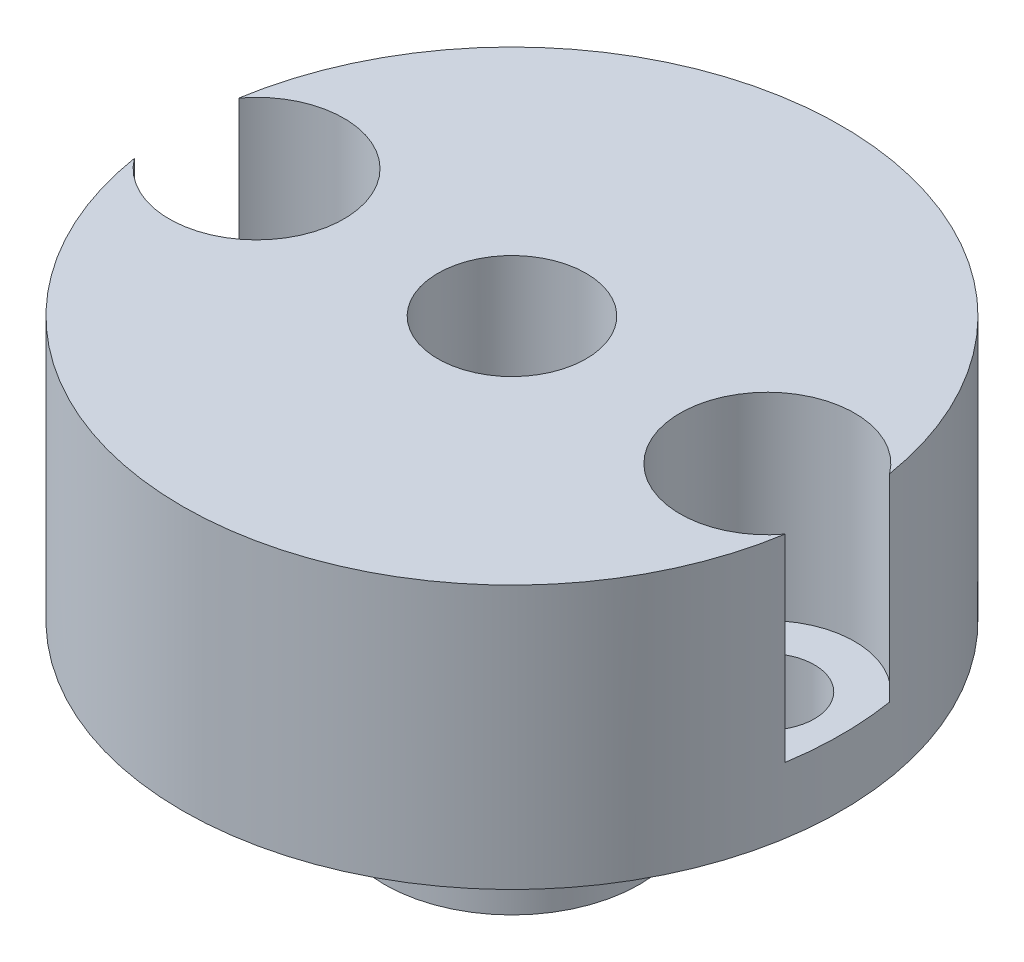
ISO-10303-21;
HEADER;
FILE_DESCRIPTION(('STEP AP214'),'2;1');
FILE_NAME('part.step','',(''),(''),'','','');
FILE_SCHEMA(('AUTOMOTIVE_DESIGN { 1 0 10303 214 1 1 1 1 }'));
ENDSEC;
DATA;
#1=APPLICATION_CONTEXT('core data for automotive mechanical design processes');
#2=APPLICATION_PROTOCOL_DEFINITION('international standard','automotive_design',2000,#1);
#3=PRODUCT_CONTEXT('',#1,'mechanical');
#4=PRODUCT('Part','Part','',(#3));
#5=PRODUCT_RELATED_PRODUCT_CATEGORY('part','',(#4));
#6=PRODUCT_DEFINITION_FORMATION('','',#4);
#7=PRODUCT_DEFINITION_CONTEXT('part definition',#1,'design');
#8=PRODUCT_DEFINITION('design','',#6,#7);
#9=PRODUCT_DEFINITION_SHAPE('','',#8);
#10=(LENGTH_UNIT() NAMED_UNIT(*) SI_UNIT(.MILLI.,.METRE.));
#11=(NAMED_UNIT(*) PLANE_ANGLE_UNIT() SI_UNIT($,.RADIAN.));
#12=(NAMED_UNIT(*) SI_UNIT($,.STERADIAN.) SOLID_ANGLE_UNIT());
#13=UNCERTAINTY_MEASURE_WITH_UNIT(LENGTH_MEASURE(1.E-05),#10,'distance_accuracy_value','');
#14=(GEOMETRIC_REPRESENTATION_CONTEXT(3) GLOBAL_UNCERTAINTY_ASSIGNED_CONTEXT((#13)) GLOBAL_UNIT_ASSIGNED_CONTEXT((#10,
#11,#12)) REPRESENTATION_CONTEXT('',''));
#15=CARTESIAN_POINT('',(0.,0.,0.));
#16=DIRECTION('',(0.,0.,1.));
#17=DIRECTION('',(1.,0.,0.));
#18=AXIS2_PLACEMENT_3D('',#15,#16,#17);
#19=CARTESIAN_POINT('',(7.75,-4.03050865276332,0.));
#20=DIRECTION('',(0.,1.,0.));
#21=DIRECTION('',(0.,0.,1.));
#22=AXIS2_PLACEMENT_3D('',#19,#20,#21);
#23=CYLINDRICAL_SURFACE('',#22,1.425);
#24=CARTESIAN_POINT('',(7.75,0.999999999999999,0.));
#25=DIRECTION('',(0.,1.,0.));
#26=DIRECTION('',(0.,0.,1.));
#27=AXIS2_PLACEMENT_3D('',#24,#25,#26);
#28=CIRCLE('',#27,1.425);
#29=CARTESIAN_POINT('',(7.75,0.999999999999999,1.425));
#30=VERTEX_POINT('',#29);
#31=EDGE_CURVE('E124',#30,#30,#28,.T.);
#32=ORIENTED_EDGE('',*,*,#31,.F.);
#33=EDGE_LOOP('',(#32));
#34=FACE_BOUND('',#33,.T.);
#35=CARTESIAN_POINT('',(7.75,3.,0.));
#36=DIRECTION('',(0.,1.,0.));
#37=DIRECTION('',(0.,0.,1.));
#38=AXIS2_PLACEMENT_3D('',#35,#36,#37);
#39=CIRCLE('',#38,1.425);
#40=CARTESIAN_POINT('',(7.75,3.,1.425));
#41=VERTEX_POINT('',#40);
#42=EDGE_CURVE('E37',#41,#41,#39,.F.);
#43=ORIENTED_EDGE('',*,*,#42,.F.);
#44=EDGE_LOOP('',(#43));
#45=FACE_BOUND('',#44,.T.);
#46=ADVANCED_FACE('F33',(#34,#45),#23,.F.);
#47=CARTESIAN_POINT('',(-7.75,-4.03050865276332,0.));
#48=DIRECTION('',(0.,1.,0.));
#49=DIRECTION('',(0.,0.,1.));
#50=AXIS2_PLACEMENT_3D('',#47,#48,#49);
#51=CYLINDRICAL_SURFACE('',#50,1.425);
#52=CARTESIAN_POINT('',(-7.75,0.999999999999999,0.));
#53=DIRECTION('',(0.,1.,0.));
#54=DIRECTION('',(0.,0.,1.));
#55=AXIS2_PLACEMENT_3D('',#52,#53,#54);
#56=CIRCLE('',#55,1.425);
#57=CARTESIAN_POINT('',(-7.75,0.999999999999999,1.425));
#58=VERTEX_POINT('',#57);
#59=EDGE_CURVE('E103',#58,#58,#56,.T.);
#60=ORIENTED_EDGE('',*,*,#59,.F.);
#61=EDGE_LOOP('',(#60));
#62=FACE_BOUND('',#61,.T.);
#63=CARTESIAN_POINT('',(-7.75,3.,0.));
#64=DIRECTION('',(0.,1.,0.));
#65=DIRECTION('',(0.,0.,1.));
#66=AXIS2_PLACEMENT_3D('',#63,#64,#65);
#67=CIRCLE('',#66,1.425);
#68=CARTESIAN_POINT('',(-7.75,3.,1.425));
#69=VERTEX_POINT('',#68);
#70=EDGE_CURVE('E112',#69,#69,#67,.F.);
#71=ORIENTED_EDGE('',*,*,#70,.F.);
#72=EDGE_LOOP('',(#71));
#73=FACE_BOUND('',#72,.T.);
#74=ADVANCED_FACE('F136',(#62,#73),#51,.F.);
#75=CARTESIAN_POINT('',(0.,24.2735064736294,0.));
#76=DIRECTION('',(0.,-1.,0.));
#77=DIRECTION('',(0.,0.,-1.));
#78=AXIS2_PLACEMENT_3D('',#75,#76,#77);
#79=CYLINDRICAL_SURFACE('',#78,5.4);
#80=CARTESIAN_POINT('',(0.,0.,0.));
#81=DIRECTION('',(0.,1.,0.));
#82=DIRECTION('',(0.,0.,1.));
#83=AXIS2_PLACEMENT_3D('',#80,#81,#82);
#84=CIRCLE('',#83,5.4);
#85=CARTESIAN_POINT('',(0.,0.,5.4));
#86=VERTEX_POINT('',#85);
#87=EDGE_CURVE('E101',#86,#86,#84,.T.);
#88=ORIENTED_EDGE('',*,*,#87,.T.);
#89=EDGE_LOOP('',(#88));
#90=FACE_BOUND('',#89,.T.);
#91=CARTESIAN_POINT('',(0.,0.999999999999997,0.));
#92=DIRECTION('',(0.,1.,0.));
#93=DIRECTION('',(0.,0.,1.));
#94=AXIS2_PLACEMENT_3D('',#91,#92,#93);
#95=CIRCLE('',#94,5.4);
#96=CARTESIAN_POINT('',(0.,0.999999999999997,5.4));
#97=VERTEX_POINT('',#96);
#98=EDGE_CURVE('E11',#97,#97,#95,.T.);
#99=ORIENTED_EDGE('',*,*,#98,.F.);
#100=EDGE_LOOP('',(#99));
#101=FACE_BOUND('',#100,.T.);
#102=ADVANCED_FACE('F139',(#90,#101),#79,.T.);
#103=CARTESIAN_POINT('',(0.,-4.,0.));
#104=DIRECTION('',(0.,1.,0.));
#105=DIRECTION('',(0.,0.,1.));
#106=AXIS2_PLACEMENT_3D('',#103,#104,#105);
#107=CYLINDRICAL_SURFACE('',#106,3.875);
#108=CARTESIAN_POINT('',(0.,-4.,0.));
#109=DIRECTION('',(0.,1.,0.));
#110=DIRECTION('',(0.,0.,1.));
#111=AXIS2_PLACEMENT_3D('',#108,#109,#110);
#112=CIRCLE('',#111,3.875);
#113=CARTESIAN_POINT('',(0.,-4.,3.875));
#114=VERTEX_POINT('',#113);
#115=EDGE_CURVE('E42',#114,#114,#112,.T.);
#116=ORIENTED_EDGE('',*,*,#115,.T.);
#117=EDGE_LOOP('',(#116));
#118=FACE_BOUND('',#117,.T.);
#119=CARTESIAN_POINT('',(0.,0.,0.));
#120=DIRECTION('',(0.,1.,0.));
#121=DIRECTION('',(0.,0.,1.));
#122=AXIS2_PLACEMENT_3D('',#119,#120,#121);
#123=CIRCLE('',#122,3.875);
#124=CARTESIAN_POINT('',(0.,0.,3.875));
#125=VERTEX_POINT('',#124);
#126=EDGE_CURVE('E108',#125,#125,#123,.F.);
#127=ORIENTED_EDGE('',*,*,#126,.T.);
#128=EDGE_LOOP('',(#127));
#129=FACE_BOUND('',#128,.T.);
#130=ADVANCED_FACE('F35',(#118,#129),#107,.T.);
#131=CARTESIAN_POINT('',(0.,-4.,0.));
#132=DIRECTION('',(0.,1.,0.));
#133=DIRECTION('',(0.,0.,1.));
#134=AXIS2_PLACEMENT_3D('',#131,#132,#133);
#135=PLANE('',#134);
#136=CARTESIAN_POINT('',(0.,-4.,0.));
#137=DIRECTION('',(0.,1.,0.));
#138=DIRECTION('',(0.,0.,1.));
#139=AXIS2_PLACEMENT_3D('',#136,#137,#138);
#140=CIRCLE('',#139,2.25);
#141=CARTESIAN_POINT('',(0.,-4.,2.25));
#142=VERTEX_POINT('',#141);
#143=EDGE_CURVE('E85',#142,#142,#140,.T.);
#144=ORIENTED_EDGE('',*,*,#143,.T.);
#145=EDGE_LOOP('',(#144));
#146=FACE_BOUND('',#145,.T.);
#147=ORIENTED_EDGE('',*,*,#115,.F.);
#148=EDGE_LOOP('',(#147));
#149=FACE_BOUND('',#148,.T.);
#150=ADVANCED_FACE('F160',(#146,#149),#135,.F.);
#151=CARTESIAN_POINT('',(0.,0.,0.));
#152=DIRECTION('',(0.,1.,0.));
#153=DIRECTION('',(0.,0.,1.));
#154=AXIS2_PLACEMENT_3D('',#151,#152,#153);
#155=PLANE('',#154);
#156=ORIENTED_EDGE('',*,*,#126,.F.);
#157=EDGE_LOOP('',(#156));
#158=FACE_BOUND('',#157,.T.);
#159=ORIENTED_EDGE('',*,*,#87,.F.);
#160=EDGE_LOOP('',(#159));
#161=FACE_BOUND('',#160,.T.);
#162=ADVANCED_FACE('F158',(#158,#161),#155,.F.);
#163=CARTESIAN_POINT('',(0.,0.999999999999999,0.));
#164=DIRECTION('',(0.,1.,0.));
#165=DIRECTION('',(0.,0.,1.));
#166=AXIS2_PLACEMENT_3D('',#163,#164,#165);
#167=CYLINDRICAL_SURFACE('',#166,10.);
#168=DIRECTION('',(0.,1.,0.));
#169=VECTOR('',#168,1.);
#170=CARTESIAN_POINT('',(9.87354838709677,6.,-1.58525778586913));
#171=LINE('',#170,#169);
#172=CARTESIAN_POINT('',(9.87354838709677,3.,-1.58525778586913));
#173=VERTEX_POINT('',#172);
#174=CARTESIAN_POINT('',(9.87354838709677,9.,-1.58525778586913));
#175=VERTEX_POINT('',#174);
#176=EDGE_CURVE('E50',#173,#175,#171,.T.);
#177=ORIENTED_EDGE('',*,*,#176,.F.);
#178=CARTESIAN_POINT('',(0.,3.,0.));
#179=DIRECTION('',(0.,1.,0.));
#180=DIRECTION('',(0.,0.,1.));
#181=AXIS2_PLACEMENT_3D('',#178,#179,#180);
#182=CIRCLE('',#181,10.);
#183=CARTESIAN_POINT('',(9.87354838709677,3.,1.58525778586913));
#184=VERTEX_POINT('',#183);
#185=EDGE_CURVE('E93',#173,#184,#182,.F.);
#186=ORIENTED_EDGE('',*,*,#185,.T.);
#187=DIRECTION('',(0.,1.,0.));
#188=VECTOR('',#187,1.);
#189=CARTESIAN_POINT('',(9.87354838709677,6.,1.58525778586913));
#190=LINE('',#189,#188);
#191=CARTESIAN_POINT('',(9.87354838709677,9.,1.58525778586913));
#192=VERTEX_POINT('',#191);
#193=EDGE_CURVE('E79',#192,#184,#190,.F.);
#194=ORIENTED_EDGE('',*,*,#193,.F.);
#195=CARTESIAN_POINT('',(0.,9.,0.));
#196=DIRECTION('',(0.,1.,0.));
#197=DIRECTION('',(0.,0.,1.));
#198=AXIS2_PLACEMENT_3D('',#195,#196,#197);
#199=CIRCLE('',#198,10.);
#200=CARTESIAN_POINT('',(-9.87354838709677,9.,1.58525778586913));
#201=VERTEX_POINT('',#200);
#202=EDGE_CURVE('E92',#201,#192,#199,.T.);
#203=ORIENTED_EDGE('',*,*,#202,.F.);
#204=DIRECTION('',(0.,1.,0.));
#205=VECTOR('',#204,1.);
#206=CARTESIAN_POINT('',(-9.87354838709677,6.,1.58525778586913));
#207=LINE('',#206,#205);
#208=CARTESIAN_POINT('',(-9.87354838709677,3.,1.58525778586913));
#209=VERTEX_POINT('',#208);
#210=EDGE_CURVE('E58',#209,#201,#207,.T.);
#211=ORIENTED_EDGE('',*,*,#210,.F.);
#212=CARTESIAN_POINT('',(0.,3.,0.));
#213=DIRECTION('',(0.,1.,0.));
#214=DIRECTION('',(0.,0.,1.));
#215=AXIS2_PLACEMENT_3D('',#212,#213,#214);
#216=CIRCLE('',#215,10.);
#217=CARTESIAN_POINT('',(-9.87354838709677,3.,-1.58525778586913));
#218=VERTEX_POINT('',#217);
#219=EDGE_CURVE('E114',#209,#218,#216,.F.);
#220=ORIENTED_EDGE('',*,*,#219,.T.);
#221=DIRECTION('',(0.,1.,0.));
#222=VECTOR('',#221,1.);
#223=CARTESIAN_POINT('',(-9.87354838709677,6.,-1.58525778586913));
#224=LINE('',#223,#222);
#225=CARTESIAN_POINT('',(-9.87354838709677,9.,-1.58525778586913));
#226=VERTEX_POINT('',#225);
#227=EDGE_CURVE('E119',#226,#218,#224,.F.);
#228=ORIENTED_EDGE('',*,*,#227,.F.);
#229=EDGE_CURVE('E98',#175,#226,#199,.T.);
#230=ORIENTED_EDGE('',*,*,#229,.F.);
#231=EDGE_LOOP('',(#177,#186,#194,#203,#211,#220,#228,#230));
#232=FACE_BOUND('',#231,.T.);
#233=CARTESIAN_POINT('',(0.,0.999999999999999,0.));
#234=DIRECTION('',(0.,1.,0.));
#235=DIRECTION('',(0.,0.,1.));
#236=AXIS2_PLACEMENT_3D('',#233,#234,#235);
#237=CIRCLE('',#236,10.);
#238=CARTESIAN_POINT('',(0.,0.999999999999999,10.));
#239=VERTEX_POINT('',#238);
#240=EDGE_CURVE('E97',#239,#239,#237,.T.);
#241=ORIENTED_EDGE('',*,*,#240,.T.);
#242=EDGE_LOOP('',(#241));
#243=FACE_BOUND('',#242,.T.);
#244=ADVANCED_FACE('F90',(#232,#243),#167,.T.);
#245=CARTESIAN_POINT('',(0.,0.999999999999999,0.));
#246=DIRECTION('',(0.,1.,0.));
#247=DIRECTION('',(0.,0.,1.));
#248=AXIS2_PLACEMENT_3D('',#245,#246,#247);
#249=PLANE('',#248);
#250=ORIENTED_EDGE('',*,*,#31,.T.);
#251=EDGE_LOOP('',(#250));
#252=FACE_BOUND('',#251,.T.);
#253=ORIENTED_EDGE('',*,*,#59,.T.);
#254=EDGE_LOOP('',(#253));
#255=FACE_BOUND('',#254,.T.);
#256=ORIENTED_EDGE('',*,*,#98,.T.);
#257=EDGE_LOOP('',(#256));
#258=FACE_BOUND('',#257,.T.);
#259=ORIENTED_EDGE('',*,*,#240,.F.);
#260=EDGE_LOOP('',(#259));
#261=FACE_BOUND('',#260,.T.);
#262=ADVANCED_FACE('F133',(#252,#255,#258,#261),#249,.F.);
#263=CARTESIAN_POINT('',(0.,9.,0.));
#264=DIRECTION('',(0.,1.,0.));
#265=DIRECTION('',(0.,0.,1.));
#266=AXIS2_PLACEMENT_3D('',#263,#264,#265);
#267=PLANE('',#266);
#268=CARTESIAN_POINT('',(0.,9.,0.));
#269=DIRECTION('',(0.,-1.,0.));
#270=DIRECTION('',(0.,0.,-1.));
#271=AXIS2_PLACEMENT_3D('',#268,#269,#270);
#272=CIRCLE('',#271,2.25);
#273=CARTESIAN_POINT('',(0.,9.,-2.25));
#274=VERTEX_POINT('',#273);
#275=EDGE_CURVE('E185',#274,#274,#272,.T.);
#276=ORIENTED_EDGE('',*,*,#275,.T.);
#277=EDGE_LOOP('',(#276));
#278=FACE_BOUND('',#277,.T.);
#279=CARTESIAN_POINT('',(7.75,9.,0.));
#280=DIRECTION('',(0.,1.,0.));
#281=DIRECTION('',(0.,0.,-1.));
#282=AXIS2_PLACEMENT_3D('',#279,#280,#281);
#283=CIRCLE('',#282,2.65);
#284=EDGE_CURVE('E76',#175,#192,#283,.T.);
#285=ORIENTED_EDGE('',*,*,#284,.F.);
#286=ORIENTED_EDGE('',*,*,#229,.T.);
#287=CARTESIAN_POINT('',(-7.75,9.,0.));
#288=DIRECTION('',(0.,1.,0.));
#289=DIRECTION('',(0.,0.,1.));
#290=AXIS2_PLACEMENT_3D('',#287,#288,#289);
#291=CIRCLE('',#290,2.65);
#292=EDGE_CURVE('E96',#201,#226,#291,.T.);
#293=ORIENTED_EDGE('',*,*,#292,.F.);
#294=ORIENTED_EDGE('',*,*,#202,.T.);
#295=EDGE_LOOP('',(#285,#286,#293,#294));
#296=FACE_BOUND('',#295,.T.);
#297=ADVANCED_FACE('F95',(#278,#296),#267,.T.);
#298=CARTESIAN_POINT('',(-7.75,3.,0.));
#299=DIRECTION('',(0.,1.,0.));
#300=DIRECTION('',(0.,0.,1.));
#301=AXIS2_PLACEMENT_3D('',#298,#299,#300);
#302=PLANE('',#301);
#303=CARTESIAN_POINT('',(-7.75,3.,0.));
#304=DIRECTION('',(0.,1.,0.));
#305=DIRECTION('',(0.,0.,1.));
#306=AXIS2_PLACEMENT_3D('',#303,#304,#305);
#307=CIRCLE('',#306,2.65);
#308=EDGE_CURVE('E115',#209,#218,#307,.T.);
#309=ORIENTED_EDGE('',*,*,#308,.T.);
#310=ORIENTED_EDGE('',*,*,#219,.F.);
#311=EDGE_LOOP('',(#309,#310));
#312=FACE_BOUND('',#311,.T.);
#313=ORIENTED_EDGE('',*,*,#70,.T.);
#314=EDGE_LOOP('',(#313));
#315=FACE_BOUND('',#314,.T.);
#316=ADVANCED_FACE('F164',(#312,#315),#302,.T.);
#317=CARTESIAN_POINT('',(-7.75,3.,0.));
#318=DIRECTION('',(0.,1.,0.));
#319=DIRECTION('',(0.,0.,1.));
#320=AXIS2_PLACEMENT_3D('',#317,#318,#319);
#321=CYLINDRICAL_SURFACE('',#320,2.65);
#322=ORIENTED_EDGE('',*,*,#210,.T.);
#323=ORIENTED_EDGE('',*,*,#292,.T.);
#324=ORIENTED_EDGE('',*,*,#227,.T.);
#325=ORIENTED_EDGE('',*,*,#308,.F.);
#326=EDGE_LOOP('',(#322,#323,#324,#325));
#327=FACE_BOUND('',#326,.T.);
#328=ADVANCED_FACE('F151',(#327),#321,.F.);
#329=CARTESIAN_POINT('',(7.75,3.,0.));
#330=DIRECTION('',(0.,1.,0.));
#331=DIRECTION('',(0.,0.,-1.));
#332=AXIS2_PLACEMENT_3D('',#329,#330,#331);
#333=PLANE('',#332);
#334=CARTESIAN_POINT('',(7.75,3.,0.));
#335=DIRECTION('',(0.,1.,0.));
#336=DIRECTION('',(0.,0.,-1.));
#337=AXIS2_PLACEMENT_3D('',#334,#335,#336);
#338=CIRCLE('',#337,2.65);
#339=EDGE_CURVE('E84',#173,#184,#338,.T.);
#340=ORIENTED_EDGE('',*,*,#339,.T.);
#341=ORIENTED_EDGE('',*,*,#185,.F.);
#342=EDGE_LOOP('',(#340,#341));
#343=FACE_BOUND('',#342,.T.);
#344=ORIENTED_EDGE('',*,*,#42,.T.);
#345=EDGE_LOOP('',(#344));
#346=FACE_BOUND('',#345,.T.);
#347=ADVANCED_FACE('F197',(#343,#346),#333,.T.);
#348=CARTESIAN_POINT('',(7.75,3.,0.));
#349=DIRECTION('',(0.,1.,0.));
#350=DIRECTION('',(0.,0.,1.));
#351=AXIS2_PLACEMENT_3D('',#348,#349,#350);
#352=CYLINDRICAL_SURFACE('',#351,2.65);
#353=ORIENTED_EDGE('',*,*,#176,.T.);
#354=ORIENTED_EDGE('',*,*,#284,.T.);
#355=ORIENTED_EDGE('',*,*,#193,.T.);
#356=ORIENTED_EDGE('',*,*,#339,.F.);
#357=EDGE_LOOP('',(#353,#354,#355,#356));
#358=FACE_BOUND('',#357,.T.);
#359=ADVANCED_FACE('F78',(#358),#352,.F.);
#360=CARTESIAN_POINT('',(0.,9.,0.));
#361=DIRECTION('',(0.,-1.,0.));
#362=DIRECTION('',(0.,0.,-1.));
#363=AXIS2_PLACEMENT_3D('',#360,#361,#362);
#364=CYLINDRICAL_SURFACE('',#363,2.25);
#365=ORIENTED_EDGE('',*,*,#275,.F.);
#366=EDGE_LOOP('',(#365));
#367=FACE_BOUND('',#366,.T.);
#368=ORIENTED_EDGE('',*,*,#143,.F.);
#369=EDGE_LOOP('',(#368));
#370=FACE_BOUND('',#369,.T.);
#371=ADVANCED_FACE('F205',(#367,#370),#364,.F.);
#372=CLOSED_SHELL('',(#46,#74,#102,#130,#150,#162,#244,#262,#297,#316,#328,#347,#359,#371));
#373=MANIFOLD_SOLID_BREP('B2',#372);
#374=ADVANCED_BREP_SHAPE_REPRESENTATION('',(#18,#373),#14);
#375=SHAPE_DEFINITION_REPRESENTATION(#9,#374);
ENDSEC;
END-ISO-10303-21;
